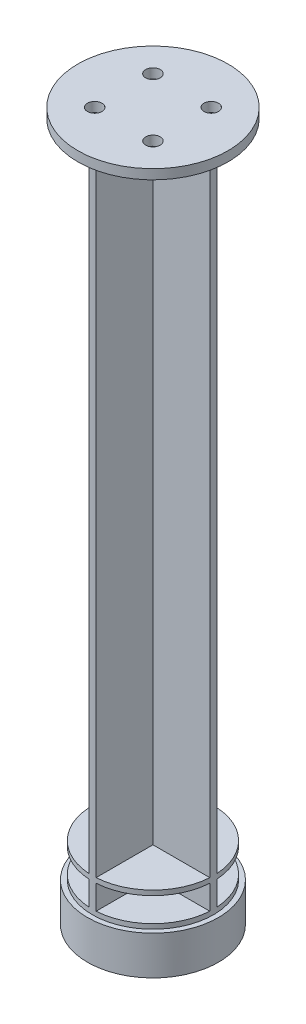
ISO-10303-21;
HEADER;
FILE_DESCRIPTION(('STEP AP214'),'2;1');
FILE_NAME('part.step','',(''),(''),'','','');
FILE_SCHEMA(('AUTOMOTIVE_DESIGN { 1 0 10303 214 1 1 1 1 }'));
ENDSEC;
DATA;
#1=APPLICATION_CONTEXT('core data for automotive mechanical design processes');
#2=APPLICATION_PROTOCOL_DEFINITION('international standard','automotive_design',2000,#1);
#3=PRODUCT_CONTEXT('',#1,'mechanical');
#4=PRODUCT('Part','Part','',(#3));
#5=PRODUCT_RELATED_PRODUCT_CATEGORY('part','',(#4));
#6=PRODUCT_DEFINITION_FORMATION('','',#4);
#7=PRODUCT_DEFINITION_CONTEXT('part definition',#1,'design');
#8=PRODUCT_DEFINITION('design','',#6,#7);
#9=PRODUCT_DEFINITION_SHAPE('','',#8);
#10=(LENGTH_UNIT() NAMED_UNIT(*) SI_UNIT(.MILLI.,.METRE.));
#11=(NAMED_UNIT(*) PLANE_ANGLE_UNIT() SI_UNIT($,.RADIAN.));
#12=(NAMED_UNIT(*) SI_UNIT($,.STERADIAN.) SOLID_ANGLE_UNIT());
#13=UNCERTAINTY_MEASURE_WITH_UNIT(LENGTH_MEASURE(1.E-05),#10,'distance_accuracy_value','');
#14=(GEOMETRIC_REPRESENTATION_CONTEXT(3) GLOBAL_UNCERTAINTY_ASSIGNED_CONTEXT((#13)) GLOBAL_UNIT_ASSIGNED_CONTEXT((#10,
#11,#12)) REPRESENTATION_CONTEXT('',''));
#15=CARTESIAN_POINT('',(0.,0.,0.));
#16=DIRECTION('',(0.,0.,1.));
#17=DIRECTION('',(1.,0.,0.));
#18=AXIS2_PLACEMENT_3D('',#15,#16,#17);
#19=CARTESIAN_POINT('',(-0.75,144.,12.4774797134678));
#20=DIRECTION('',(1.,0.,0.));
#21=DIRECTION('',(0.,0.,-1.));
#22=AXIS2_PLACEMENT_3D('',#19,#20,#21);
#23=PLANE('',#22);
#24=DIRECTION('',(0.,0.,1.));
#25=VECTOR('',#24,1.);
#26=CARTESIAN_POINT('',(-0.75,14.,12.4774797134678));
#27=LINE('',#26,#25);
#28=CARTESIAN_POINT('',(-0.75,14.,0.75));
#29=VERTEX_POINT('',#28);
#30=CARTESIAN_POINT('',(-0.75,14.,12.4774797134678));
#31=VERTEX_POINT('',#30);
#32=EDGE_CURVE('E303',#29,#31,#27,.T.);
#33=ORIENTED_EDGE('',*,*,#32,.F.);
#34=DIRECTION('',(0.,-1.,0.));
#35=VECTOR('',#34,1.);
#36=CARTESIAN_POINT('',(-0.75,144.,0.75));
#37=LINE('',#36,#35);
#38=CARTESIAN_POINT('',(-0.75,9.,0.75));
#39=VERTEX_POINT('',#38);
#40=EDGE_CURVE('E219',#29,#39,#37,.T.);
#41=ORIENTED_EDGE('',*,*,#40,.T.);
#42=DIRECTION('',(0.,0.,1.));
#43=VECTOR('',#42,1.);
#44=CARTESIAN_POINT('',(-0.75,9.,12.4774797134678));
#45=LINE('',#44,#43);
#46=CARTESIAN_POINT('',(-0.75,9.,12.4774797134678));
#47=VERTEX_POINT('',#46);
#48=EDGE_CURVE('E230',#39,#47,#45,.T.);
#49=ORIENTED_EDGE('',*,*,#48,.T.);
#50=DIRECTION('',(0.,-1.,0.));
#51=VECTOR('',#50,1.);
#52=CARTESIAN_POINT('',(-0.75,144.,12.4774797134678));
#53=LINE('',#52,#51);
#54=EDGE_CURVE('E52',#31,#47,#53,.T.);
#55=ORIENTED_EDGE('',*,*,#54,.F.);
#56=EDGE_LOOP('',(#33,#41,#49,#55));
#57=FACE_BOUND('',#56,.T.);
#58=ADVANCED_FACE('F37',(#57),#23,.F.);
#59=CARTESIAN_POINT('',(0.75,144.,0.749999999999998));
#60=DIRECTION('',(-1.,0.,0.));
#61=DIRECTION('',(0.,0.,1.));
#62=AXIS2_PLACEMENT_3D('',#59,#60,#61);
#63=PLANE('',#62);
#64=DIRECTION('',(0.,0.,-1.));
#65=VECTOR('',#64,1.);
#66=CARTESIAN_POINT('',(0.75,14.,0.749999999999998));
#67=LINE('',#66,#65);
#68=CARTESIAN_POINT('',(0.750000000000002,14.,12.4774797134678));
#69=VERTEX_POINT('',#68);
#70=CARTESIAN_POINT('',(0.75,14.,0.749999999999998));
#71=VERTEX_POINT('',#70);
#72=EDGE_CURVE('E348',#69,#71,#67,.T.);
#73=ORIENTED_EDGE('',*,*,#72,.F.);
#74=DIRECTION('',(0.,-1.,0.));
#75=VECTOR('',#74,1.);
#76=CARTESIAN_POINT('',(0.750000000000002,144.,12.4774797134678));
#77=LINE('',#76,#75);
#78=CARTESIAN_POINT('',(0.750000000000002,9.,12.4774797134678));
#79=VERTEX_POINT('',#78);
#80=EDGE_CURVE('E285',#69,#79,#77,.T.);
#81=ORIENTED_EDGE('',*,*,#80,.T.);
#82=DIRECTION('',(0.,0.,-1.));
#83=VECTOR('',#82,1.);
#84=CARTESIAN_POINT('',(0.75,9.,0.749999999999998));
#85=LINE('',#84,#83);
#86=CARTESIAN_POINT('',(0.75,9.,0.749999999999998));
#87=VERTEX_POINT('',#86);
#88=EDGE_CURVE('E232',#79,#87,#85,.T.);
#89=ORIENTED_EDGE('',*,*,#88,.T.);
#90=DIRECTION('',(0.,-1.,0.));
#91=VECTOR('',#90,1.);
#92=CARTESIAN_POINT('',(0.75,144.,0.749999999999998));
#93=LINE('',#92,#91);
#94=EDGE_CURVE('E281',#71,#87,#93,.T.);
#95=ORIENTED_EDGE('',*,*,#94,.F.);
#96=EDGE_LOOP('',(#73,#81,#89,#95));
#97=FACE_BOUND('',#96,.T.);
#98=ADVANCED_FACE('F440',(#97),#63,.F.);
#99=CARTESIAN_POINT('',(12.4774797134678,144.,0.749999999999996));
#100=DIRECTION('',(0.,0.,-1.));
#101=DIRECTION('',(-1.,0.,0.));
#102=AXIS2_PLACEMENT_3D('',#99,#100,#101);
#103=PLANE('',#102);
#104=DIRECTION('',(1.,0.,0.));
#105=VECTOR('',#104,1.);
#106=CARTESIAN_POINT('',(12.4774797134678,14.,0.749999999999996));
#107=LINE('',#106,#105);
#108=CARTESIAN_POINT('',(12.4774797134678,14.,0.749999999999996));
#109=VERTEX_POINT('',#108);
#110=EDGE_CURVE('E345',#71,#109,#107,.T.);
#111=ORIENTED_EDGE('',*,*,#110,.F.);
#112=ORIENTED_EDGE('',*,*,#94,.T.);
#113=DIRECTION('',(1.,0.,0.));
#114=VECTOR('',#113,1.);
#115=CARTESIAN_POINT('',(12.4774797134678,9.,0.749999999999996));
#116=LINE('',#115,#114);
#117=CARTESIAN_POINT('',(12.4774797134678,9.,0.749999999999996));
#118=VERTEX_POINT('',#117);
#119=EDGE_CURVE('E236',#87,#118,#116,.T.);
#120=ORIENTED_EDGE('',*,*,#119,.T.);
#121=DIRECTION('',(0.,-1.,0.));
#122=VECTOR('',#121,1.);
#123=CARTESIAN_POINT('',(12.4774797134678,144.,0.749999999999998));
#124=LINE('',#123,#122);
#125=EDGE_CURVE('E277',#109,#118,#124,.T.);
#126=ORIENTED_EDGE('',*,*,#125,.F.);
#127=EDGE_LOOP('',(#111,#112,#120,#126));
#128=FACE_BOUND('',#127,.T.);
#129=ADVANCED_FACE('F446',(#128),#103,.F.);
#130=CARTESIAN_POINT('',(0.750000000000002,144.,-0.750000000000002));
#131=DIRECTION('',(0.,0.,1.));
#132=DIRECTION('',(1.,0.,0.));
#133=AXIS2_PLACEMENT_3D('',#130,#131,#132);
#134=PLANE('',#133);
#135=DIRECTION('',(-1.,0.,0.));
#136=VECTOR('',#135,1.);
#137=CARTESIAN_POINT('',(0.750000000000002,14.,-0.750000000000002));
#138=LINE('',#137,#136);
#139=CARTESIAN_POINT('',(12.4774797134678,14.,-0.750000000000002));
#140=VERTEX_POINT('',#139);
#141=CARTESIAN_POINT('',(0.750000000000002,14.,-0.750000000000002));
#142=VERTEX_POINT('',#141);
#143=EDGE_CURVE('E339',#140,#142,#138,.T.);
#144=ORIENTED_EDGE('',*,*,#143,.F.);
#145=DIRECTION('',(0.,-1.,0.));
#146=VECTOR('',#145,1.);
#147=CARTESIAN_POINT('',(12.4774797134678,144.,-0.750000000000002));
#148=LINE('',#147,#146);
#149=CARTESIAN_POINT('',(12.4774797134678,9.,-0.750000000000002));
#150=VERTEX_POINT('',#149);
#151=EDGE_CURVE('E274',#140,#150,#148,.T.);
#152=ORIENTED_EDGE('',*,*,#151,.T.);
#153=DIRECTION('',(-1.,0.,0.));
#154=VECTOR('',#153,1.);
#155=CARTESIAN_POINT('',(0.750000000000002,9.,-0.750000000000002));
#156=LINE('',#155,#154);
#157=CARTESIAN_POINT('',(0.750000000000002,9.,-0.750000000000002));
#158=VERTEX_POINT('',#157);
#159=EDGE_CURVE('E239',#150,#158,#156,.T.);
#160=ORIENTED_EDGE('',*,*,#159,.T.);
#161=DIRECTION('',(0.,-1.,0.));
#162=VECTOR('',#161,1.);
#163=CARTESIAN_POINT('',(0.750000000000002,144.,-0.750000000000002));
#164=LINE('',#163,#162);
#165=EDGE_CURVE('E270',#142,#158,#164,.T.);
#166=ORIENTED_EDGE('',*,*,#165,.F.);
#167=EDGE_LOOP('',(#144,#152,#160,#166));
#168=FACE_BOUND('',#167,.T.);
#169=ADVANCED_FACE('F338',(#168),#134,.F.);
#170=CARTESIAN_POINT('',(0.75,144.,-12.4774797134678));
#171=DIRECTION('',(-1.,0.,0.));
#172=DIRECTION('',(0.,0.,1.));
#173=AXIS2_PLACEMENT_3D('',#170,#171,#172);
#174=PLANE('',#173);
#175=DIRECTION('',(0.,0.,-1.));
#176=VECTOR('',#175,1.);
#177=CARTESIAN_POINT('',(0.75,14.,-12.4774797134678));
#178=LINE('',#177,#176);
#179=CARTESIAN_POINT('',(0.75,14.,-12.4774797134678));
#180=VERTEX_POINT('',#179);
#181=EDGE_CURVE('E335',#142,#180,#178,.T.);
#182=ORIENTED_EDGE('',*,*,#181,.F.);
#183=ORIENTED_EDGE('',*,*,#165,.T.);
#184=DIRECTION('',(0.,0.,-1.));
#185=VECTOR('',#184,1.);
#186=CARTESIAN_POINT('',(0.75,9.,-12.4774797134678));
#187=LINE('',#186,#185);
#188=CARTESIAN_POINT('',(0.75,9.,-12.4774797134678));
#189=VERTEX_POINT('',#188);
#190=EDGE_CURVE('E242',#158,#189,#187,.T.);
#191=ORIENTED_EDGE('',*,*,#190,.T.);
#192=DIRECTION('',(0.,-1.,0.));
#193=VECTOR('',#192,1.);
#194=CARTESIAN_POINT('',(0.749999999999999,144.,-12.4774797134678));
#195=LINE('',#194,#193);
#196=EDGE_CURVE('E266',#180,#189,#195,.T.);
#197=ORIENTED_EDGE('',*,*,#196,.F.);
#198=EDGE_LOOP('',(#182,#183,#191,#197));
#199=FACE_BOUND('',#198,.T.);
#200=ADVANCED_FACE('F332',(#199),#174,.F.);
#201=CARTESIAN_POINT('',(-0.75,144.,-0.749999999999998));
#202=DIRECTION('',(1.,0.,0.));
#203=DIRECTION('',(0.,0.,-1.));
#204=AXIS2_PLACEMENT_3D('',#201,#202,#203);
#205=PLANE('',#204);
#206=DIRECTION('',(0.,0.,1.));
#207=VECTOR('',#206,1.);
#208=CARTESIAN_POINT('',(-0.75,14.,-0.749999999999998));
#209=LINE('',#208,#207);
#210=CARTESIAN_POINT('',(-0.75,14.,-12.4774797134678));
#211=VERTEX_POINT('',#210);
#212=CARTESIAN_POINT('',(-0.75,14.,-0.749999999999998));
#213=VERTEX_POINT('',#212);
#214=EDGE_CURVE('E350',#211,#213,#209,.T.);
#215=ORIENTED_EDGE('',*,*,#214,.F.);
#216=DIRECTION('',(0.,-1.,0.));
#217=VECTOR('',#216,1.);
#218=CARTESIAN_POINT('',(-0.75,144.,-12.4774797134678));
#219=LINE('',#218,#217);
#220=CARTESIAN_POINT('',(-0.749999999999999,9.,-12.4774797134678));
#221=VERTEX_POINT('',#220);
#222=EDGE_CURVE('E263',#211,#221,#219,.T.);
#223=ORIENTED_EDGE('',*,*,#222,.T.);
#224=DIRECTION('',(0.,0.,1.));
#225=VECTOR('',#224,1.);
#226=CARTESIAN_POINT('',(-0.75,9.,-0.749999999999998));
#227=LINE('',#226,#225);
#228=CARTESIAN_POINT('',(-0.75,9.,-0.749999999999998));
#229=VERTEX_POINT('',#228);
#230=EDGE_CURVE('E245',#221,#229,#227,.T.);
#231=ORIENTED_EDGE('',*,*,#230,.T.);
#232=DIRECTION('',(0.,-1.,0.));
#233=VECTOR('',#232,1.);
#234=CARTESIAN_POINT('',(-0.75,144.,-0.749999999999998));
#235=LINE('',#234,#233);
#236=EDGE_CURVE('E259',#213,#229,#235,.T.);
#237=ORIENTED_EDGE('',*,*,#236,.F.);
#238=EDGE_LOOP('',(#215,#223,#231,#237));
#239=FACE_BOUND('',#238,.T.);
#240=ADVANCED_FACE('F559',(#239),#205,.F.);
#241=CARTESIAN_POINT('',(-12.4774797134678,144.,-0.749999999999999));
#242=DIRECTION('',(0.,0.,1.));
#243=DIRECTION('',(1.,0.,0.));
#244=AXIS2_PLACEMENT_3D('',#241,#242,#243);
#245=PLANE('',#244);
#246=DIRECTION('',(-1.,0.,0.));
#247=VECTOR('',#246,1.);
#248=CARTESIAN_POINT('',(-12.4774797134678,14.,-0.749999999999999));
#249=LINE('',#248,#247);
#250=CARTESIAN_POINT('',(-12.4774797134678,14.,-0.749999999999999));
#251=VERTEX_POINT('',#250);
#252=EDGE_CURVE('E415',#213,#251,#249,.T.);
#253=ORIENTED_EDGE('',*,*,#252,.F.);
#254=ORIENTED_EDGE('',*,*,#236,.T.);
#255=DIRECTION('',(-1.,0.,0.));
#256=VECTOR('',#255,1.);
#257=CARTESIAN_POINT('',(-12.4774797134678,9.,-0.749999999999999));
#258=LINE('',#257,#256);
#259=CARTESIAN_POINT('',(-12.4774797134678,9.,-0.749999999999999));
#260=VERTEX_POINT('',#259);
#261=EDGE_CURVE('E248',#229,#260,#258,.T.);
#262=ORIENTED_EDGE('',*,*,#261,.T.);
#263=DIRECTION('',(0.,-1.,0.));
#264=VECTOR('',#263,1.);
#265=CARTESIAN_POINT('',(-12.4774797134678,144.,-0.749999999999999));
#266=LINE('',#265,#264);
#267=EDGE_CURVE('E255',#251,#260,#266,.T.);
#268=ORIENTED_EDGE('',*,*,#267,.F.);
#269=EDGE_LOOP('',(#253,#254,#262,#268));
#270=FACE_BOUND('',#269,.T.);
#271=ADVANCED_FACE('F555',(#270),#245,.F.);
#272=CARTESIAN_POINT('',(-0.75,144.,0.75));
#273=DIRECTION('',(0.,0.,-1.));
#274=DIRECTION('',(-1.,0.,0.));
#275=AXIS2_PLACEMENT_3D('',#272,#273,#274);
#276=PLANE('',#275);
#277=DIRECTION('',(1.,0.,0.));
#278=VECTOR('',#277,1.);
#279=CARTESIAN_POINT('',(-0.75,14.,0.75));
#280=LINE('',#279,#278);
#281=CARTESIAN_POINT('',(-12.4774797134678,14.,0.750000000000001));
#282=VERTEX_POINT('',#281);
#283=EDGE_CURVE('E45',#282,#29,#280,.T.);
#284=ORIENTED_EDGE('',*,*,#283,.F.);
#285=DIRECTION('',(0.,-1.,0.));
#286=VECTOR('',#285,1.);
#287=CARTESIAN_POINT('',(-12.4774797134678,144.,0.750000000000001));
#288=LINE('',#287,#286);
#289=CARTESIAN_POINT('',(-12.4774797134678,9.,0.750000000000001));
#290=VERTEX_POINT('',#289);
#291=EDGE_CURVE('E218',#282,#290,#288,.T.);
#292=ORIENTED_EDGE('',*,*,#291,.T.);
#293=DIRECTION('',(1.,0.,0.));
#294=VECTOR('',#293,1.);
#295=CARTESIAN_POINT('',(-0.75,9.,0.75));
#296=LINE('',#295,#294);
#297=EDGE_CURVE('E210',#290,#39,#296,.T.);
#298=ORIENTED_EDGE('',*,*,#297,.T.);
#299=ORIENTED_EDGE('',*,*,#40,.F.);
#300=EDGE_LOOP('',(#284,#292,#298,#299));
#301=FACE_BOUND('',#300,.T.);
#302=ADVANCED_FACE('F308',(#301),#276,.F.);
#303=CARTESIAN_POINT('',(0.,9.,0.));
#304=DIRECTION('',(0.,1.,0.));
#305=DIRECTION('',(0.,0.,1.));
#306=AXIS2_PLACEMENT_3D('',#303,#304,#305);
#307=PLANE('',#306);
#308=ORIENTED_EDGE('',*,*,#48,.F.);
#309=ORIENTED_EDGE('',*,*,#297,.F.);
#310=CARTESIAN_POINT('',(0.,9.,0.));
#311=DIRECTION('',(0.,1.,0.));
#312=DIRECTION('',(0.,0.,1.));
#313=AXIS2_PLACEMENT_3D('',#310,#311,#312);
#314=CIRCLE('',#313,12.5);
#315=EDGE_CURVE('E289',#290,#47,#314,.T.);
#316=ORIENTED_EDGE('',*,*,#315,.T.);
#317=EDGE_LOOP('',(#308,#309,#316));
#318=FACE_BOUND('',#317,.T.);
#319=ADVANCED_FACE('F458',(#318),#307,.T.);
#320=ORIENTED_EDGE('',*,*,#261,.F.);
#321=ORIENTED_EDGE('',*,*,#230,.F.);
#322=EDGE_CURVE('E317',#221,#260,#314,.T.);
#323=ORIENTED_EDGE('',*,*,#322,.T.);
#324=EDGE_LOOP('',(#320,#321,#323));
#325=FACE_BOUND('',#324,.T.);
#326=ADVANCED_FACE('F605',(#325),#307,.T.);
#327=ORIENTED_EDGE('',*,*,#190,.F.);
#328=ORIENTED_EDGE('',*,*,#159,.F.);
#329=EDGE_CURVE('E294',#150,#189,#314,.T.);
#330=ORIENTED_EDGE('',*,*,#329,.T.);
#331=EDGE_LOOP('',(#327,#328,#330));
#332=FACE_BOUND('',#331,.T.);
#333=ADVANCED_FACE('F328',(#332),#307,.T.);
#334=CARTESIAN_POINT('',(0.,8.,0.));
#335=DIRECTION('',(0.,-1.,0.));
#336=DIRECTION('',(0.,0.,-1.));
#337=AXIS2_PLACEMENT_3D('',#334,#335,#336);
#338=CYLINDRICAL_SURFACE('',#337,13.5);
#339=CARTESIAN_POINT('',(0.,8.,0.));
#340=DIRECTION('',(0.,1.,0.));
#341=DIRECTION('',(0.,0.,1.));
#342=AXIS2_PLACEMENT_3D('',#339,#340,#341);
#343=CIRCLE('',#342,13.5);
#344=CARTESIAN_POINT('',(0.,8.,13.5));
#345=VERTEX_POINT('',#344);
#346=EDGE_CURVE('E293',#345,#345,#343,.T.);
#347=ORIENTED_EDGE('',*,*,#346,.F.);
#348=EDGE_LOOP('',(#347));
#349=FACE_BOUND('',#348,.T.);
#350=CARTESIAN_POINT('',(0.,0.,0.));
#351=DIRECTION('',(0.,1.,0.));
#352=DIRECTION('',(-1.,0.,0.));
#353=AXIS2_PLACEMENT_3D('',#350,#351,#352);
#354=CIRCLE('',#353,13.5);
#355=CARTESIAN_POINT('',(-13.5,0.,0.));
#356=VERTEX_POINT('',#355);
#357=EDGE_CURVE('E473',#356,#356,#354,.T.);
#358=ORIENTED_EDGE('',*,*,#357,.T.);
#359=EDGE_LOOP('',(#358));
#360=FACE_BOUND('',#359,.T.);
#361=ADVANCED_FACE('F39',(#349,#360),#338,.T.);
#362=CARTESIAN_POINT('',(0.,8.,0.));
#363=DIRECTION('',(0.,1.,0.));
#364=DIRECTION('',(0.,0.,1.));
#365=AXIS2_PLACEMENT_3D('',#362,#363,#364);
#366=PLANE('',#365);
#367=CARTESIAN_POINT('',(0.,8.,0.));
#368=DIRECTION('',(0.,1.,0.));
#369=DIRECTION('',(0.,0.,1.));
#370=AXIS2_PLACEMENT_3D('',#367,#368,#369);
#371=CIRCLE('',#370,12.5);
#372=CARTESIAN_POINT('',(0.,8.,12.5));
#373=VERTEX_POINT('',#372);
#374=EDGE_CURVE('E295',#373,#373,#371,.T.);
#375=ORIENTED_EDGE('',*,*,#374,.F.);
#376=EDGE_LOOP('',(#375));
#377=FACE_BOUND('',#376,.T.);
#378=ORIENTED_EDGE('',*,*,#346,.T.);
#379=EDGE_LOOP('',(#378));
#380=FACE_BOUND('',#379,.T.);
#381=ADVANCED_FACE('F460',(#377,#380),#366,.T.);
#382=CARTESIAN_POINT('',(0.,9.,0.));
#383=DIRECTION('',(0.,-1.,0.));
#384=DIRECTION('',(0.,0.,-1.));
#385=AXIS2_PLACEMENT_3D('',#382,#383,#384);
#386=CYLINDRICAL_SURFACE('',#385,12.5);
#387=CARTESIAN_POINT('',(-0.75,144.,12.4774797134678));
#388=VERTEX_POINT('',#387);
#389=CARTESIAN_POINT('',(-0.75,15.,12.4774797134678));
#390=VERTEX_POINT('',#389);
#391=EDGE_CURVE('E205',#388,#390,#53,.T.);
#392=ORIENTED_EDGE('',*,*,#391,.T.);
#393=CARTESIAN_POINT('',(0.,15.,0.));
#394=DIRECTION('',(0.,1.,0.));
#395=DIRECTION('',(0.,0.,1.));
#396=AXIS2_PLACEMENT_3D('',#393,#394,#395);
#397=CIRCLE('',#396,12.5);
#398=CARTESIAN_POINT('',(-12.4774797134678,15.,0.750000000000001));
#399=VERTEX_POINT('',#398);
#400=EDGE_CURVE('E399',#399,#390,#397,.T.);
#401=ORIENTED_EDGE('',*,*,#400,.F.);
#402=CARTESIAN_POINT('',(-12.4774797134678,144.,0.750000000000001));
#403=VERTEX_POINT('',#402);
#404=EDGE_CURVE('E253',#403,#399,#288,.T.);
#405=ORIENTED_EDGE('',*,*,#404,.F.);
#406=CARTESIAN_POINT('',(0.,144.,0.));
#407=DIRECTION('',(0.,1.,0.));
#408=DIRECTION('',(0.,0.,1.));
#409=AXIS2_PLACEMENT_3D('',#406,#407,#408);
#410=CIRCLE('',#409,12.5);
#411=CARTESIAN_POINT('',(-12.4774797134678,144.,-0.749999999999999));
#412=VERTEX_POINT('',#411);
#413=EDGE_CURVE('E224',#412,#403,#410,.T.);
#414=ORIENTED_EDGE('',*,*,#413,.F.);
#415=CARTESIAN_POINT('',(-12.4774797134678,15.,-0.749999999999999));
#416=VERTEX_POINT('',#415);
#417=EDGE_CURVE('E256',#412,#416,#266,.T.);
#418=ORIENTED_EDGE('',*,*,#417,.T.);
#419=CARTESIAN_POINT('',(-0.75,15.,-12.4774797134678));
#420=VERTEX_POINT('',#419);
#421=EDGE_CURVE('E402',#420,#416,#397,.T.);
#422=ORIENTED_EDGE('',*,*,#421,.F.);
#423=CARTESIAN_POINT('',(-0.75,144.,-12.4774797134678));
#424=VERTEX_POINT('',#423);
#425=EDGE_CURVE('E264',#424,#420,#219,.T.);
#426=ORIENTED_EDGE('',*,*,#425,.F.);
#427=CARTESIAN_POINT('',(0.,144.,0.));
#428=DIRECTION('',(0.,1.,0.));
#429=DIRECTION('',(0.,0.,1.));
#430=AXIS2_PLACEMENT_3D('',#427,#428,#429);
#431=CIRCLE('',#430,12.5);
#432=CARTESIAN_POINT('',(0.749999999999999,144.,-12.4774797134678));
#433=VERTEX_POINT('',#432);
#434=EDGE_CURVE('E384',#433,#424,#431,.T.);
#435=ORIENTED_EDGE('',*,*,#434,.F.);
#436=CARTESIAN_POINT('',(0.749999999999999,15.,-12.4774797134678));
#437=VERTEX_POINT('',#436);
#438=EDGE_CURVE('E267',#433,#437,#195,.T.);
#439=ORIENTED_EDGE('',*,*,#438,.T.);
#440=CARTESIAN_POINT('',(12.4774797134678,15.,-0.750000000000002));
#441=VERTEX_POINT('',#440);
#442=EDGE_CURVE('E406',#441,#437,#397,.T.);
#443=ORIENTED_EDGE('',*,*,#442,.F.);
#444=CARTESIAN_POINT('',(12.4774797134678,144.,-0.750000000000002));
#445=VERTEX_POINT('',#444);
#446=EDGE_CURVE('E275',#445,#441,#148,.T.);
#447=ORIENTED_EDGE('',*,*,#446,.F.);
#448=CARTESIAN_POINT('',(0.,144.,0.));
#449=DIRECTION('',(0.,1.,0.));
#450=DIRECTION('',(0.,0.,1.));
#451=AXIS2_PLACEMENT_3D('',#448,#449,#450);
#452=CIRCLE('',#451,12.5);
#453=CARTESIAN_POINT('',(12.4774797134678,144.,0.749999999999998));
#454=VERTEX_POINT('',#453);
#455=EDGE_CURVE('E375',#454,#445,#452,.T.);
#456=ORIENTED_EDGE('',*,*,#455,.F.);
#457=CARTESIAN_POINT('',(12.4774797134678,15.,0.749999999999998));
#458=VERTEX_POINT('',#457);
#459=EDGE_CURVE('E278',#454,#458,#124,.T.);
#460=ORIENTED_EDGE('',*,*,#459,.T.);
#461=CARTESIAN_POINT('',(0.750000000000002,15.,12.4774797134678));
#462=VERTEX_POINT('',#461);
#463=EDGE_CURVE('E405',#462,#458,#397,.T.);
#464=ORIENTED_EDGE('',*,*,#463,.F.);
#465=CARTESIAN_POINT('',(0.750000000000002,144.,12.4774797134678));
#466=VERTEX_POINT('',#465);
#467=EDGE_CURVE('E286',#466,#462,#77,.T.);
#468=ORIENTED_EDGE('',*,*,#467,.F.);
#469=CARTESIAN_POINT('',(0.,144.,0.));
#470=DIRECTION('',(0.,1.,0.));
#471=DIRECTION('',(0.,0.,1.));
#472=AXIS2_PLACEMENT_3D('',#469,#470,#471);
#473=CIRCLE('',#472,12.5);
#474=EDGE_CURVE('E209',#388,#466,#473,.T.);
#475=ORIENTED_EDGE('',*,*,#474,.F.);
#476=EDGE_LOOP('',(#392,#401,#405,#414,#418,#422,#426,#435,#439,#443,#447,#456,#460,#464,#468,#475));
#477=FACE_BOUND('',#476,.T.);
#478=ORIENTED_EDGE('',*,*,#151,.F.);
#479=CARTESIAN_POINT('',(0.,14.,0.));
#480=DIRECTION('',(0.,1.,0.));
#481=DIRECTION('',(0.,0.,1.));
#482=AXIS2_PLACEMENT_3D('',#479,#480,#481);
#483=CIRCLE('',#482,12.5);
#484=EDGE_CURVE('E344',#140,#180,#483,.T.);
#485=ORIENTED_EDGE('',*,*,#484,.T.);
#486=ORIENTED_EDGE('',*,*,#196,.T.);
#487=ORIENTED_EDGE('',*,*,#329,.F.);
#488=EDGE_LOOP('',(#478,#485,#486,#487));
#489=FACE_BOUND('',#488,.T.);
#490=ORIENTED_EDGE('',*,*,#222,.F.);
#491=EDGE_CURVE('E476',#211,#251,#483,.T.);
#492=ORIENTED_EDGE('',*,*,#491,.T.);
#493=ORIENTED_EDGE('',*,*,#267,.T.);
#494=ORIENTED_EDGE('',*,*,#322,.F.);
#495=EDGE_LOOP('',(#490,#492,#493,#494));
#496=FACE_BOUND('',#495,.T.);
#497=ORIENTED_EDGE('',*,*,#291,.F.);
#498=EDGE_CURVE('E305',#282,#31,#483,.T.);
#499=ORIENTED_EDGE('',*,*,#498,.T.);
#500=ORIENTED_EDGE('',*,*,#54,.T.);
#501=ORIENTED_EDGE('',*,*,#315,.F.);
#502=EDGE_LOOP('',(#497,#499,#500,#501));
#503=FACE_BOUND('',#502,.T.);
#504=ORIENTED_EDGE('',*,*,#374,.T.);
#505=EDGE_LOOP('',(#504));
#506=FACE_BOUND('',#505,.T.);
#507=EDGE_CURVE('E403',#69,#109,#483,.T.);
#508=ORIENTED_EDGE('',*,*,#507,.T.);
#509=ORIENTED_EDGE('',*,*,#125,.T.);
#510=EDGE_CURVE('E290',#79,#118,#314,.T.);
#511=ORIENTED_EDGE('',*,*,#510,.F.);
#512=ORIENTED_EDGE('',*,*,#80,.F.);
#513=EDGE_LOOP('',(#508,#509,#511,#512));
#514=FACE_BOUND('',#513,.T.);
#515=ADVANCED_FACE('F312',(#477,#489,#496,#503,#506,#514),#386,.T.);
#516=ORIENTED_EDGE('',*,*,#119,.F.);
#517=ORIENTED_EDGE('',*,*,#88,.F.);
#518=ORIENTED_EDGE('',*,*,#510,.T.);
#519=EDGE_LOOP('',(#516,#517,#518));
#520=FACE_BOUND('',#519,.T.);
#521=ADVANCED_FACE('F447',(#520),#307,.T.);
#522=CARTESIAN_POINT('',(-0.75,144.,0.75));
#523=VERTEX_POINT('',#522);
#524=CARTESIAN_POINT('',(-0.75,15.,0.75));
#525=VERTEX_POINT('',#524);
#526=EDGE_CURVE('E204',#523,#525,#37,.T.);
#527=ORIENTED_EDGE('',*,*,#526,.T.);
#528=DIRECTION('',(0.,0.,1.));
#529=VECTOR('',#528,1.);
#530=CARTESIAN_POINT('',(-0.75,15.,12.4774797134678));
#531=LINE('',#530,#529);
#532=EDGE_CURVE('E60',#525,#390,#531,.T.);
#533=ORIENTED_EDGE('',*,*,#532,.T.);
#534=ORIENTED_EDGE('',*,*,#391,.F.);
#535=DIRECTION('',(0.,0.,1.));
#536=VECTOR('',#535,1.);
#537=CARTESIAN_POINT('',(-0.75,144.,12.4774797134678));
#538=LINE('',#537,#536);
#539=EDGE_CURVE('E201',#523,#388,#538,.T.);
#540=ORIENTED_EDGE('',*,*,#539,.F.);
#541=EDGE_LOOP('',(#527,#533,#534,#540));
#542=FACE_BOUND('',#541,.T.);
#543=ADVANCED_FACE('F203',(#542),#23,.F.);
#544=ORIENTED_EDGE('',*,*,#467,.T.);
#545=DIRECTION('',(0.,0.,-1.));
#546=VECTOR('',#545,1.);
#547=CARTESIAN_POINT('',(0.75,15.,0.749999999999998));
#548=LINE('',#547,#546);
#549=CARTESIAN_POINT('',(0.75,15.,0.749999999999998));
#550=VERTEX_POINT('',#549);
#551=EDGE_CURVE('E233',#462,#550,#548,.T.);
#552=ORIENTED_EDGE('',*,*,#551,.T.);
#553=CARTESIAN_POINT('',(0.75,144.,0.749999999999998));
#554=VERTEX_POINT('',#553);
#555=EDGE_CURVE('E282',#554,#550,#93,.T.);
#556=ORIENTED_EDGE('',*,*,#555,.F.);
#557=DIRECTION('',(0.,0.,-1.));
#558=VECTOR('',#557,1.);
#559=CARTESIAN_POINT('',(0.75,144.,0.749999999999998));
#560=LINE('',#559,#558);
#561=EDGE_CURVE('E369',#466,#554,#560,.T.);
#562=ORIENTED_EDGE('',*,*,#561,.F.);
#563=EDGE_LOOP('',(#544,#552,#556,#562));
#564=FACE_BOUND('',#563,.T.);
#565=ADVANCED_FACE('F436',(#564),#63,.F.);
#566=ORIENTED_EDGE('',*,*,#555,.T.);
#567=DIRECTION('',(1.,0.,0.));
#568=VECTOR('',#567,1.);
#569=CARTESIAN_POINT('',(12.4774797134678,15.,0.749999999999996));
#570=LINE('',#569,#568);
#571=EDGE_CURVE('E365',#550,#458,#570,.T.);
#572=ORIENTED_EDGE('',*,*,#571,.T.);
#573=ORIENTED_EDGE('',*,*,#459,.F.);
#574=DIRECTION('',(1.,0.,0.));
#575=VECTOR('',#574,1.);
#576=CARTESIAN_POINT('',(12.4774797134678,144.,0.749999999999996));
#577=LINE('',#576,#575);
#578=EDGE_CURVE('E372',#554,#454,#577,.T.);
#579=ORIENTED_EDGE('',*,*,#578,.F.);
#580=EDGE_LOOP('',(#566,#572,#573,#579));
#581=FACE_BOUND('',#580,.T.);
#582=ADVANCED_FACE('F433',(#581),#103,.F.);
#583=ORIENTED_EDGE('',*,*,#446,.T.);
#584=DIRECTION('',(-1.,0.,0.));
#585=VECTOR('',#584,1.);
#586=CARTESIAN_POINT('',(0.750000000000002,15.,-0.750000000000002));
#587=LINE('',#586,#585);
#588=CARTESIAN_POINT('',(0.750000000000002,15.,-0.750000000000002));
#589=VERTEX_POINT('',#588);
#590=EDGE_CURVE('E363',#441,#589,#587,.T.);
#591=ORIENTED_EDGE('',*,*,#590,.T.);
#592=CARTESIAN_POINT('',(0.750000000000002,144.,-0.750000000000002));
#593=VERTEX_POINT('',#592);
#594=EDGE_CURVE('E271',#593,#589,#164,.T.);
#595=ORIENTED_EDGE('',*,*,#594,.F.);
#596=DIRECTION('',(-1.,0.,0.));
#597=VECTOR('',#596,1.);
#598=CARTESIAN_POINT('',(0.750000000000002,144.,-0.750000000000002));
#599=LINE('',#598,#597);
#600=EDGE_CURVE('E378',#445,#593,#599,.T.);
#601=ORIENTED_EDGE('',*,*,#600,.F.);
#602=EDGE_LOOP('',(#583,#591,#595,#601));
#603=FACE_BOUND('',#602,.T.);
#604=ADVANCED_FACE('F430',(#603),#134,.F.);
#605=ORIENTED_EDGE('',*,*,#594,.T.);
#606=DIRECTION('',(0.,0.,-1.));
#607=VECTOR('',#606,1.);
#608=CARTESIAN_POINT('',(0.75,15.,-12.4774797134678));
#609=LINE('',#608,#607);
#610=EDGE_CURVE('E361',#589,#437,#609,.T.);
#611=ORIENTED_EDGE('',*,*,#610,.T.);
#612=ORIENTED_EDGE('',*,*,#438,.F.);
#613=DIRECTION('',(0.,0.,-1.));
#614=VECTOR('',#613,1.);
#615=CARTESIAN_POINT('',(0.75,144.,-12.4774797134678));
#616=LINE('',#615,#614);
#617=EDGE_CURVE('E381',#593,#433,#616,.T.);
#618=ORIENTED_EDGE('',*,*,#617,.F.);
#619=EDGE_LOOP('',(#605,#611,#612,#618));
#620=FACE_BOUND('',#619,.T.);
#621=ADVANCED_FACE('F428',(#620),#174,.F.);
#622=ORIENTED_EDGE('',*,*,#425,.T.);
#623=DIRECTION('',(0.,0.,1.));
#624=VECTOR('',#623,1.);
#625=CARTESIAN_POINT('',(-0.75,15.,-0.749999999999998));
#626=LINE('',#625,#624);
#627=CARTESIAN_POINT('',(-0.75,15.,-0.749999999999998));
#628=VERTEX_POINT('',#627);
#629=EDGE_CURVE('E359',#420,#628,#626,.T.);
#630=ORIENTED_EDGE('',*,*,#629,.T.);
#631=CARTESIAN_POINT('',(-0.75,144.,-0.749999999999998));
#632=VERTEX_POINT('',#631);
#633=EDGE_CURVE('E260',#632,#628,#235,.T.);
#634=ORIENTED_EDGE('',*,*,#633,.F.);
#635=DIRECTION('',(0.,0.,1.));
#636=VECTOR('',#635,1.);
#637=CARTESIAN_POINT('',(-0.75,144.,-0.749999999999998));
#638=LINE('',#637,#636);
#639=EDGE_CURVE('E387',#424,#632,#638,.T.);
#640=ORIENTED_EDGE('',*,*,#639,.F.);
#641=EDGE_LOOP('',(#622,#630,#634,#640));
#642=FACE_BOUND('',#641,.T.);
#643=ADVANCED_FACE('F554',(#642),#205,.F.);
#644=ORIENTED_EDGE('',*,*,#633,.T.);
#645=DIRECTION('',(-1.,0.,0.));
#646=VECTOR('',#645,1.);
#647=CARTESIAN_POINT('',(-12.4774797134678,15.,-0.749999999999999));
#648=LINE('',#647,#646);
#649=EDGE_CURVE('E357',#628,#416,#648,.T.);
#650=ORIENTED_EDGE('',*,*,#649,.T.);
#651=ORIENTED_EDGE('',*,*,#417,.F.);
#652=DIRECTION('',(-1.,0.,0.));
#653=VECTOR('',#652,1.);
#654=CARTESIAN_POINT('',(-12.4774797134678,144.,-0.749999999999999));
#655=LINE('',#654,#653);
#656=EDGE_CURVE('E226',#632,#412,#655,.T.);
#657=ORIENTED_EDGE('',*,*,#656,.F.);
#658=EDGE_LOOP('',(#644,#650,#651,#657));
#659=FACE_BOUND('',#658,.T.);
#660=ADVANCED_FACE('F392',(#659),#245,.F.);
#661=ORIENTED_EDGE('',*,*,#404,.T.);
#662=DIRECTION('',(1.,0.,0.));
#663=VECTOR('',#662,1.);
#664=CARTESIAN_POINT('',(-0.75,15.,0.75));
#665=LINE('',#664,#663);
#666=EDGE_CURVE('E11',#399,#525,#665,.T.);
#667=ORIENTED_EDGE('',*,*,#666,.T.);
#668=ORIENTED_EDGE('',*,*,#526,.F.);
#669=DIRECTION('',(1.,0.,0.));
#670=VECTOR('',#669,1.);
#671=CARTESIAN_POINT('',(-0.75,144.,0.75));
#672=LINE('',#671,#670);
#673=EDGE_CURVE('E215',#403,#523,#672,.T.);
#674=ORIENTED_EDGE('',*,*,#673,.F.);
#675=EDGE_LOOP('',(#661,#667,#668,#674));
#676=FACE_BOUND('',#675,.T.);
#677=ADVANCED_FACE('F214',(#676),#276,.F.);
#678=CARTESIAN_POINT('',(0.,15.,0.));
#679=DIRECTION('',(0.,1.,0.));
#680=DIRECTION('',(0.,0.,1.));
#681=AXIS2_PLACEMENT_3D('',#678,#679,#680);
#682=PLANE('',#681);
#683=ORIENTED_EDGE('',*,*,#532,.F.);
#684=ORIENTED_EDGE('',*,*,#666,.F.);
#685=ORIENTED_EDGE('',*,*,#400,.T.);
#686=EDGE_LOOP('',(#683,#684,#685));
#687=FACE_BOUND('',#686,.T.);
#688=ADVANCED_FACE('F401',(#687),#682,.T.);
#689=CARTESIAN_POINT('',(0.,14.,0.));
#690=DIRECTION('',(0.,1.,0.));
#691=DIRECTION('',(0.,0.,1.));
#692=AXIS2_PLACEMENT_3D('',#689,#690,#691);
#693=PLANE('',#692);
#694=ORIENTED_EDGE('',*,*,#283,.T.);
#695=ORIENTED_EDGE('',*,*,#32,.T.);
#696=ORIENTED_EDGE('',*,*,#498,.F.);
#697=EDGE_LOOP('',(#694,#695,#696));
#698=FACE_BOUND('',#697,.T.);
#699=ADVANCED_FACE('F302',(#698),#693,.F.);
#700=ORIENTED_EDGE('',*,*,#491,.F.);
#701=ORIENTED_EDGE('',*,*,#214,.T.);
#702=ORIENTED_EDGE('',*,*,#252,.T.);
#703=EDGE_LOOP('',(#700,#701,#702));
#704=FACE_BOUND('',#703,.T.);
#705=ADVANCED_FACE('F735',(#704),#693,.F.);
#706=ORIENTED_EDGE('',*,*,#629,.F.);
#707=ORIENTED_EDGE('',*,*,#421,.T.);
#708=ORIENTED_EDGE('',*,*,#649,.F.);
#709=EDGE_LOOP('',(#706,#707,#708));
#710=FACE_BOUND('',#709,.T.);
#711=ADVANCED_FACE('F738',(#710),#682,.T.);
#712=ORIENTED_EDGE('',*,*,#484,.F.);
#713=ORIENTED_EDGE('',*,*,#143,.T.);
#714=ORIENTED_EDGE('',*,*,#181,.T.);
#715=EDGE_LOOP('',(#712,#713,#714));
#716=FACE_BOUND('',#715,.T.);
#717=ADVANCED_FACE('F342',(#716),#693,.F.);
#718=ORIENTED_EDGE('',*,*,#590,.F.);
#719=ORIENTED_EDGE('',*,*,#442,.T.);
#720=ORIENTED_EDGE('',*,*,#610,.F.);
#721=EDGE_LOOP('',(#718,#719,#720));
#722=FACE_BOUND('',#721,.T.);
#723=ADVANCED_FACE('F422',(#722),#682,.T.);
#724=ORIENTED_EDGE('',*,*,#551,.F.);
#725=ORIENTED_EDGE('',*,*,#463,.T.);
#726=ORIENTED_EDGE('',*,*,#571,.F.);
#727=EDGE_LOOP('',(#724,#725,#726));
#728=FACE_BOUND('',#727,.T.);
#729=ADVANCED_FACE('F434',(#728),#682,.T.);
#730=ORIENTED_EDGE('',*,*,#507,.F.);
#731=ORIENTED_EDGE('',*,*,#72,.T.);
#732=ORIENTED_EDGE('',*,*,#110,.T.);
#733=EDGE_LOOP('',(#730,#731,#732));
#734=FACE_BOUND('',#733,.T.);
#735=ADVANCED_FACE('F540',(#734),#693,.F.);
#736=CARTESIAN_POINT('',(0.,-7.,0.));
#737=DIRECTION('',(0.,1.,0.));
#738=DIRECTION('',(-1.,0.,0.));
#739=AXIS2_PLACEMENT_3D('',#736,#737,#738);
#740=CONICAL_SURFACE('',#739,0.,1.09244389541624);
#741=ORIENTED_EDGE('',*,*,#357,.F.);
#742=EDGE_LOOP('',(#741));
#743=FACE_BOUND('',#742,.T.);
#744=CARTESIAN_POINT('',(0.,-7.,0.));
#745=VERTEX_POINT('',#744);
#746=VERTEX_LOOP('',#745);
#747=FACE_BOUND('',#746,.T.);
#748=ADVANCED_FACE('F534',(#743,#747),#740,.T.);
#749=CARTESIAN_POINT('',(0.,144.,0.));
#750=DIRECTION('',(0.,1.,0.));
#751=DIRECTION('',(0.,0.,1.));
#752=AXIS2_PLACEMENT_3D('',#749,#750,#751);
#753=PLANE('',#752);
#754=CARTESIAN_POINT('',(-6.01040764008533,144.,6.01040764008567));
#755=DIRECTION('',(0.,1.,0.));
#756=DIRECTION('',(0.,0.,1.));
#757=AXIS2_PLACEMENT_3D('',#754,#755,#756);
#758=CIRCLE('',#757,1.5);
#759=CARTESIAN_POINT('',(-6.01040764008533,144.,7.51040764008566));
#760=VERTEX_POINT('',#759);
#761=EDGE_CURVE('E493',#760,#760,#758,.T.);
#762=ORIENTED_EDGE('',*,*,#761,.T.);
#763=EDGE_LOOP('',(#762));
#764=FACE_BOUND('',#763,.T.);
#765=CARTESIAN_POINT('',(6.01040764008598,144.,6.01040764008532));
#766=DIRECTION('',(0.,1.,0.));
#767=DIRECTION('',(0.,0.,1.));
#768=AXIS2_PLACEMENT_3D('',#765,#766,#767);
#769=CIRCLE('',#768,1.5);
#770=CARTESIAN_POINT('',(6.01040764008598,144.,7.51040764008532));
#771=VERTEX_POINT('',#770);
#772=EDGE_CURVE('E499',#771,#771,#769,.T.);
#773=ORIENTED_EDGE('',*,*,#772,.T.);
#774=EDGE_LOOP('',(#773));
#775=FACE_BOUND('',#774,.T.);
#776=CARTESIAN_POINT('',(6.01040764008564,144.,-6.01040764008598));
#777=DIRECTION('',(0.,1.,0.));
#778=DIRECTION('',(0.,0.,1.));
#779=AXIS2_PLACEMENT_3D('',#776,#777,#778);
#780=CIRCLE('',#779,1.5);
#781=CARTESIAN_POINT('',(6.01040764008564,144.,-4.51040764008598));
#782=VERTEX_POINT('',#781);
#783=EDGE_CURVE('E487',#782,#782,#780,.T.);
#784=ORIENTED_EDGE('',*,*,#783,.T.);
#785=EDGE_LOOP('',(#784));
#786=FACE_BOUND('',#785,.T.);
#787=CARTESIAN_POINT('',(-6.01040764008567,144.,-6.01040764008564));
#788=DIRECTION('',(0.,1.,0.));
#789=DIRECTION('',(0.,0.,1.));
#790=AXIS2_PLACEMENT_3D('',#787,#788,#789);
#791=CIRCLE('',#790,1.5);
#792=CARTESIAN_POINT('',(-6.01040764008567,144.,-4.51040764008564));
#793=VERTEX_POINT('',#792);
#794=EDGE_CURVE('E482',#793,#793,#791,.T.);
#795=ORIENTED_EDGE('',*,*,#794,.T.);
#796=EDGE_LOOP('',(#795));
#797=FACE_BOUND('',#796,.T.);
#798=CARTESIAN_POINT('',(0.,144.,0.));
#799=DIRECTION('',(0.,1.,0.));
#800=DIRECTION('',(0.,0.,1.));
#801=AXIS2_PLACEMENT_3D('',#798,#799,#800);
#802=CIRCLE('',#801,15.5);
#803=CARTESIAN_POINT('',(0.,144.,15.5));
#804=VERTEX_POINT('',#803);
#805=EDGE_CURVE('E478',#804,#804,#802,.T.);
#806=ORIENTED_EDGE('',*,*,#805,.F.);
#807=EDGE_LOOP('',(#806));
#808=FACE_BOUND('',#807,.T.);
#809=ORIENTED_EDGE('',*,*,#673,.T.);
#810=ORIENTED_EDGE('',*,*,#539,.T.);
#811=ORIENTED_EDGE('',*,*,#474,.T.);
#812=ORIENTED_EDGE('',*,*,#561,.T.);
#813=ORIENTED_EDGE('',*,*,#578,.T.);
#814=ORIENTED_EDGE('',*,*,#455,.T.);
#815=ORIENTED_EDGE('',*,*,#600,.T.);
#816=ORIENTED_EDGE('',*,*,#617,.T.);
#817=ORIENTED_EDGE('',*,*,#434,.T.);
#818=ORIENTED_EDGE('',*,*,#639,.T.);
#819=ORIENTED_EDGE('',*,*,#656,.T.);
#820=ORIENTED_EDGE('',*,*,#413,.T.);
#821=EDGE_LOOP('',(#809,#810,#811,#812,#813,#814,#815,#816,#817,#818,#819,#820));
#822=FACE_BOUND('',#821,.T.);
#823=ADVANCED_FACE('F221',(#764,#775,#786,#797,#808,#822),#753,.F.);
#824=CARTESIAN_POINT('',(0.,146.,0.));
#825=DIRECTION('',(0.,-1.,0.));
#826=DIRECTION('',(0.,0.,-1.));
#827=AXIS2_PLACEMENT_3D('',#824,#825,#826);
#828=CYLINDRICAL_SURFACE('',#827,15.5);
#829=CARTESIAN_POINT('',(0.,146.,0.));
#830=DIRECTION('',(0.,1.,0.));
#831=DIRECTION('',(0.,0.,1.));
#832=AXIS2_PLACEMENT_3D('',#829,#830,#831);
#833=CIRCLE('',#832,15.5);
#834=CARTESIAN_POINT('',(0.,146.,15.5));
#835=VERTEX_POINT('',#834);
#836=EDGE_CURVE('E475',#835,#835,#833,.T.);
#837=ORIENTED_EDGE('',*,*,#836,.F.);
#838=EDGE_LOOP('',(#837));
#839=FACE_BOUND('',#838,.T.);
#840=ORIENTED_EDGE('',*,*,#805,.T.);
#841=EDGE_LOOP('',(#840));
#842=FACE_BOUND('',#841,.T.);
#843=ADVANCED_FACE('F521',(#839,#842),#828,.T.);
#844=CARTESIAN_POINT('',(0.,146.,0.));
#845=DIRECTION('',(0.,1.,0.));
#846=DIRECTION('',(0.,0.,1.));
#847=AXIS2_PLACEMENT_3D('',#844,#845,#846);
#848=PLANE('',#847);
#849=CARTESIAN_POINT('',(-6.01040764008533,146.,6.01040764008567));
#850=DIRECTION('',(0.,1.,0.));
#851=DIRECTION('',(0.,0.,1.));
#852=AXIS2_PLACEMENT_3D('',#849,#850,#851);
#853=CIRCLE('',#852,1.5);
#854=CARTESIAN_POINT('',(-6.01040764008533,146.,7.51040764008566));
#855=VERTEX_POINT('',#854);
#856=EDGE_CURVE('E490',#855,#855,#853,.T.);
#857=ORIENTED_EDGE('',*,*,#856,.F.);
#858=EDGE_LOOP('',(#857));
#859=FACE_BOUND('',#858,.T.);
#860=CARTESIAN_POINT('',(6.01040764008598,146.,6.01040764008532));
#861=DIRECTION('',(0.,1.,0.));
#862=DIRECTION('',(0.,0.,1.));
#863=AXIS2_PLACEMENT_3D('',#860,#861,#862);
#864=CIRCLE('',#863,1.5);
#865=CARTESIAN_POINT('',(6.01040764008598,146.,7.51040764008532));
#866=VERTEX_POINT('',#865);
#867=EDGE_CURVE('E496',#866,#866,#864,.T.);
#868=ORIENTED_EDGE('',*,*,#867,.F.);
#869=EDGE_LOOP('',(#868));
#870=FACE_BOUND('',#869,.T.);
#871=CARTESIAN_POINT('',(6.01040764008564,146.,-6.01040764008598));
#872=DIRECTION('',(0.,1.,0.));
#873=DIRECTION('',(0.,0.,1.));
#874=AXIS2_PLACEMENT_3D('',#871,#872,#873);
#875=CIRCLE('',#874,1.5);
#876=CARTESIAN_POINT('',(6.01040764008564,146.,-4.51040764008598));
#877=VERTEX_POINT('',#876);
#878=EDGE_CURVE('E502',#877,#877,#875,.T.);
#879=ORIENTED_EDGE('',*,*,#878,.F.);
#880=EDGE_LOOP('',(#879));
#881=FACE_BOUND('',#880,.T.);
#882=CARTESIAN_POINT('',(-6.01040764008567,146.,-6.01040764008564));
#883=DIRECTION('',(0.,1.,0.));
#884=DIRECTION('',(0.,0.,1.));
#885=AXIS2_PLACEMENT_3D('',#882,#883,#884);
#886=CIRCLE('',#885,1.5);
#887=CARTESIAN_POINT('',(-6.01040764008567,146.,-4.51040764008564));
#888=VERTEX_POINT('',#887);
#889=EDGE_CURVE('E484',#888,#888,#886,.T.);
#890=ORIENTED_EDGE('',*,*,#889,.F.);
#891=EDGE_LOOP('',(#890));
#892=FACE_BOUND('',#891,.T.);
#893=ORIENTED_EDGE('',*,*,#836,.T.);
#894=EDGE_LOOP('',(#893));
#895=FACE_BOUND('',#894,.T.);
#896=ADVANCED_FACE('F518',(#859,#870,#881,#892,#895),#848,.T.);
#897=CARTESIAN_POINT('',(-6.01040764008567,144.,-6.01040764008564));
#898=DIRECTION('',(0.,1.,0.));
#899=DIRECTION('',(0.,0.,1.));
#900=AXIS2_PLACEMENT_3D('',#897,#898,#899);
#901=CYLINDRICAL_SURFACE('',#900,1.5);
#902=ORIENTED_EDGE('',*,*,#794,.F.);
#903=EDGE_LOOP('',(#902));
#904=FACE_BOUND('',#903,.T.);
#905=ORIENTED_EDGE('',*,*,#889,.T.);
#906=EDGE_LOOP('',(#905));
#907=FACE_BOUND('',#906,.T.);
#908=ADVANCED_FACE('F514',(#904,#907),#901,.F.);
#909=CARTESIAN_POINT('',(6.01040764008564,144.,-6.01040764008598));
#910=DIRECTION('',(0.,1.,0.));
#911=DIRECTION('',(0.,0.,1.));
#912=AXIS2_PLACEMENT_3D('',#909,#910,#911);
#913=CYLINDRICAL_SURFACE('',#912,1.5);
#914=ORIENTED_EDGE('',*,*,#783,.F.);
#915=EDGE_LOOP('',(#914));
#916=FACE_BOUND('',#915,.T.);
#917=ORIENTED_EDGE('',*,*,#878,.T.);
#918=EDGE_LOOP('',(#917));
#919=FACE_BOUND('',#918,.T.);
#920=ADVANCED_FACE('F510',(#916,#919),#913,.F.);
#921=CARTESIAN_POINT('',(6.01040764008598,144.,6.01040764008532));
#922=DIRECTION('',(0.,1.,0.));
#923=DIRECTION('',(0.,0.,1.));
#924=AXIS2_PLACEMENT_3D('',#921,#922,#923);
#925=CYLINDRICAL_SURFACE('',#924,1.5);
#926=ORIENTED_EDGE('',*,*,#772,.F.);
#927=EDGE_LOOP('',(#926));
#928=FACE_BOUND('',#927,.T.);
#929=ORIENTED_EDGE('',*,*,#867,.T.);
#930=EDGE_LOOP('',(#929));
#931=FACE_BOUND('',#930,.T.);
#932=ADVANCED_FACE('F513',(#928,#931),#925,.F.);
#933=CARTESIAN_POINT('',(-6.01040764008533,144.,6.01040764008567));
#934=DIRECTION('',(0.,1.,0.));
#935=DIRECTION('',(0.,0.,1.));
#936=AXIS2_PLACEMENT_3D('',#933,#934,#935);
#937=CYLINDRICAL_SURFACE('',#936,1.5);
#938=ORIENTED_EDGE('',*,*,#761,.F.);
#939=EDGE_LOOP('',(#938));
#940=FACE_BOUND('',#939,.T.);
#941=ORIENTED_EDGE('',*,*,#856,.T.);
#942=EDGE_LOOP('',(#941));
#943=FACE_BOUND('',#942,.T.);
#944=ADVANCED_FACE('F801',(#940,#943),#937,.F.);
#945=CLOSED_SHELL('',(#58,#98,#129,#169,#200,#240,#271,#302,#319,#326,#333,#361,#381,#515,#521,
#543,#565,#582,#604,#621,#643,#660,#677,#688,#699,#705,#711,#717,#723,#729,#735,#748,#823,#843,
#896,#908,#920,#932,#944));
#946=MANIFOLD_SOLID_BREP('B2',#945);
#947=ADVANCED_BREP_SHAPE_REPRESENTATION('',(#18,#946),#14);
#948=SHAPE_DEFINITION_REPRESENTATION(#9,#947);
ENDSEC;
END-ISO-10303-21;
